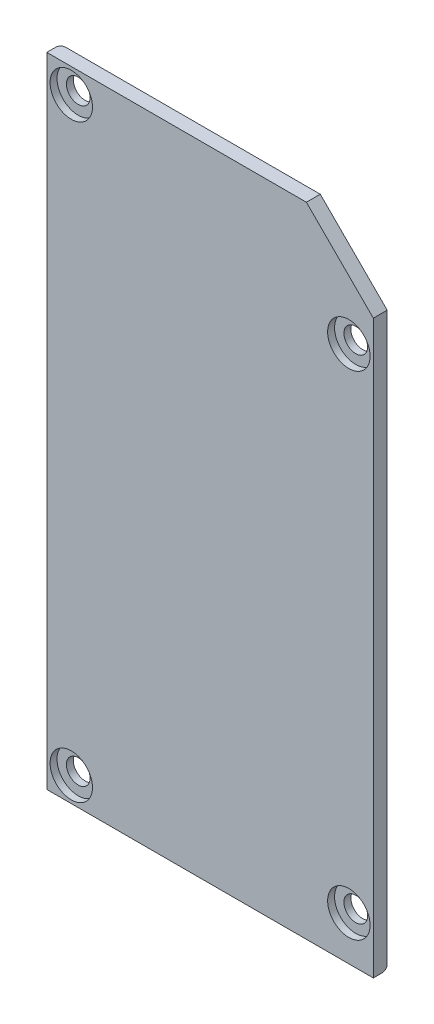
ISO-10303-21;
HEADER;
FILE_DESCRIPTION(('STEP AP214'),'2;1');
FILE_NAME('part.step','',(''),(''),'','','');
FILE_SCHEMA(('AUTOMOTIVE_DESIGN { 1 0 10303 214 1 1 1 1 }'));
ENDSEC;
DATA;
#1=APPLICATION_CONTEXT('core data for automotive mechanical design processes');
#2=APPLICATION_PROTOCOL_DEFINITION('international standard','automotive_design',2000,#1);
#3=PRODUCT_CONTEXT('',#1,'mechanical');
#4=PRODUCT('Part','Part','',(#3));
#5=PRODUCT_RELATED_PRODUCT_CATEGORY('part','',(#4));
#6=PRODUCT_DEFINITION_FORMATION('','',#4);
#7=PRODUCT_DEFINITION_CONTEXT('part definition',#1,'design');
#8=PRODUCT_DEFINITION('design','',#6,#7);
#9=PRODUCT_DEFINITION_SHAPE('','',#8);
#10=(LENGTH_UNIT() NAMED_UNIT(*) SI_UNIT(.MILLI.,.METRE.));
#11=(NAMED_UNIT(*) PLANE_ANGLE_UNIT() SI_UNIT($,.RADIAN.));
#12=(NAMED_UNIT(*) SI_UNIT($,.STERADIAN.) SOLID_ANGLE_UNIT());
#13=UNCERTAINTY_MEASURE_WITH_UNIT(LENGTH_MEASURE(1.E-05),#10,'distance_accuracy_value','');
#14=(GEOMETRIC_REPRESENTATION_CONTEXT(3) GLOBAL_UNCERTAINTY_ASSIGNED_CONTEXT((#13)) GLOBAL_UNIT_ASSIGNED_CONTEXT((#10,
#11,#12)) REPRESENTATION_CONTEXT('',''));
#15=CARTESIAN_POINT('',(0.,0.,0.));
#16=DIRECTION('',(0.,0.,1.));
#17=DIRECTION('',(1.,0.,0.));
#18=AXIS2_PLACEMENT_3D('',#15,#16,#17);
#19=CARTESIAN_POINT('',(37.,5.39999999999994,29.7));
#20=DIRECTION('',(0.,0.,-1.));
#21=DIRECTION('',(-1.,0.,0.));
#22=AXIS2_PLACEMENT_3D('',#19,#20,#21);
#23=CYLINDRICAL_SURFACE('',#22,1.45);
#24=CARTESIAN_POINT('',(37.,5.39999999999994,28.));
#25=DIRECTION('',(0.,0.,-1.));
#26=DIRECTION('',(-1.,0.,0.));
#27=AXIS2_PLACEMENT_3D('',#24,#25,#26);
#28=CIRCLE('',#27,1.45);
#29=CARTESIAN_POINT('',(35.55,5.39999999999994,28.));
#30=VERTEX_POINT('',#29);
#31=EDGE_CURVE('E238',#30,#30,#28,.T.);
#32=ORIENTED_EDGE('',*,*,#31,.T.);
#33=EDGE_LOOP('',(#32));
#34=FACE_BOUND('',#33,.T.);
#35=CARTESIAN_POINT('',(37.,5.39999999999994,28.85));
#36=DIRECTION('',(0.,0.,1.));
#37=DIRECTION('',(1.,0.,0.));
#38=AXIS2_PLACEMENT_3D('',#35,#36,#37);
#39=CIRCLE('',#38,1.45);
#40=CARTESIAN_POINT('',(38.45,5.39999999999994,28.85));
#41=VERTEX_POINT('',#40);
#42=EDGE_CURVE('E142',#41,#41,#39,.T.);
#43=ORIENTED_EDGE('',*,*,#42,.T.);
#44=EDGE_LOOP('',(#43));
#45=FACE_BOUND('',#44,.T.);
#46=ADVANCED_FACE('F37',(#34,#45),#23,.F.);
#47=CARTESIAN_POINT('',(3.,3.,29.7));
#48=DIRECTION('',(0.,0.,-1.));
#49=DIRECTION('',(-1.,0.,0.));
#50=AXIS2_PLACEMENT_3D('',#47,#48,#49);
#51=CYLINDRICAL_SURFACE('',#50,1.45);
#52=CARTESIAN_POINT('',(3.,3.,28.));
#53=DIRECTION('',(0.,0.,-1.));
#54=DIRECTION('',(-1.,0.,0.));
#55=AXIS2_PLACEMENT_3D('',#52,#53,#54);
#56=CIRCLE('',#55,1.45);
#57=CARTESIAN_POINT('',(1.55,3.,28.));
#58=VERTEX_POINT('',#57);
#59=EDGE_CURVE('E130',#58,#58,#56,.T.);
#60=ORIENTED_EDGE('',*,*,#59,.T.);
#61=EDGE_LOOP('',(#60));
#62=FACE_BOUND('',#61,.T.);
#63=CARTESIAN_POINT('',(3.,3.,28.85));
#64=DIRECTION('',(0.,0.,1.));
#65=DIRECTION('',(1.,0.,0.));
#66=AXIS2_PLACEMENT_3D('',#63,#64,#65);
#67=CIRCLE('',#66,1.45);
#68=CARTESIAN_POINT('',(4.45,3.,28.85));
#69=VERTEX_POINT('',#68);
#70=EDGE_CURVE('E137',#69,#69,#67,.T.);
#71=ORIENTED_EDGE('',*,*,#70,.T.);
#72=EDGE_LOOP('',(#71));
#73=FACE_BOUND('',#72,.T.);
#74=ADVANCED_FACE('F177',(#62,#73),#51,.F.);
#75=CARTESIAN_POINT('',(37.,65.7573593128807,29.7));
#76=DIRECTION('',(0.,0.,-1.));
#77=DIRECTION('',(-1.,0.,0.));
#78=AXIS2_PLACEMENT_3D('',#75,#76,#77);
#79=CYLINDRICAL_SURFACE('',#78,1.45);
#80=CARTESIAN_POINT('',(37.,65.7573593128807,28.));
#81=DIRECTION('',(0.,0.,-1.));
#82=DIRECTION('',(-1.,0.,0.));
#83=AXIS2_PLACEMENT_3D('',#80,#81,#82);
#84=CIRCLE('',#83,1.45);
#85=CARTESIAN_POINT('',(35.55,65.7573593128807,28.));
#86=VERTEX_POINT('',#85);
#87=EDGE_CURVE('E235',#86,#86,#84,.T.);
#88=ORIENTED_EDGE('',*,*,#87,.T.);
#89=EDGE_LOOP('',(#88));
#90=FACE_BOUND('',#89,.T.);
#91=CARTESIAN_POINT('',(37.,65.7573593128807,28.85));
#92=DIRECTION('',(0.,0.,1.));
#93=DIRECTION('',(1.,0.,0.));
#94=AXIS2_PLACEMENT_3D('',#91,#92,#93);
#95=CIRCLE('',#94,1.45);
#96=CARTESIAN_POINT('',(38.45,65.7573593128807,28.85));
#97=VERTEX_POINT('',#96);
#98=EDGE_CURVE('E132',#97,#97,#95,.T.);
#99=ORIENTED_EDGE('',*,*,#98,.T.);
#100=EDGE_LOOP('',(#99));
#101=FACE_BOUND('',#100,.T.);
#102=ADVANCED_FACE('F184',(#90,#101),#79,.F.);
#103=CARTESIAN_POINT('',(3.,75.2,29.7));
#104=DIRECTION('',(0.,0.,-1.));
#105=DIRECTION('',(-1.,0.,0.));
#106=AXIS2_PLACEMENT_3D('',#103,#104,#105);
#107=CYLINDRICAL_SURFACE('',#106,1.45);
#108=CARTESIAN_POINT('',(3.,75.2,28.));
#109=DIRECTION('',(0.,0.,-1.));
#110=DIRECTION('',(-1.,0.,0.));
#111=AXIS2_PLACEMENT_3D('',#108,#109,#110);
#112=CIRCLE('',#111,1.45);
#113=CARTESIAN_POINT('',(1.55,75.2,28.));
#114=VERTEX_POINT('',#113);
#115=EDGE_CURVE('E101',#114,#114,#112,.T.);
#116=ORIENTED_EDGE('',*,*,#115,.T.);
#117=EDGE_LOOP('',(#116));
#118=FACE_BOUND('',#117,.T.);
#119=CARTESIAN_POINT('',(3.,75.2,28.85));
#120=DIRECTION('',(0.,0.,1.));
#121=DIRECTION('',(1.,0.,0.));
#122=AXIS2_PLACEMENT_3D('',#119,#120,#121);
#123=CIRCLE('',#122,1.45);
#124=CARTESIAN_POINT('',(4.45,75.2,28.85));
#125=VERTEX_POINT('',#124);
#126=EDGE_CURVE('E127',#125,#125,#123,.T.);
#127=ORIENTED_EDGE('',*,*,#126,.T.);
#128=EDGE_LOOP('',(#127));
#129=FACE_BOUND('',#128,.T.);
#130=ADVANCED_FACE('F193',(#118,#129),#107,.F.);
#131=CARTESIAN_POINT('',(0.,0.,28.));
#132=DIRECTION('',(0.,1.,0.));
#133=DIRECTION('',(0.,0.,1.));
#134=AXIS2_PLACEMENT_3D('',#131,#132,#133);
#135=PLANE('',#134);
#136=DIRECTION('',(0.,0.,-1.));
#137=VECTOR('',#136,1.);
#138=CARTESIAN_POINT('',(0.,0.,28.));
#139=LINE('',#138,#137);
#140=CARTESIAN_POINT('',(0.,0.,29.7));
#141=VERTEX_POINT('',#140);
#142=CARTESIAN_POINT('',(0.,0.,28.6));
#143=VERTEX_POINT('',#142);
#144=EDGE_CURVE('E125',#141,#143,#139,.T.);
#145=ORIENTED_EDGE('',*,*,#144,.T.);
#146=DIRECTION('',(-1.,0.,0.));
#147=VECTOR('',#146,1.);
#148=CARTESIAN_POINT('',(40.,0.,28.6));
#149=LINE('',#148,#147);
#150=CARTESIAN_POINT('',(40.,0.,28.6));
#151=VERTEX_POINT('',#150);
#152=EDGE_CURVE('E150',#143,#151,#149,.F.);
#153=ORIENTED_EDGE('',*,*,#152,.T.);
#154=DIRECTION('',(0.,0.,-1.));
#155=VECTOR('',#154,1.);
#156=CARTESIAN_POINT('',(40.,0.,28.));
#157=LINE('',#156,#155);
#158=CARTESIAN_POINT('',(40.,0.,29.7));
#159=VERTEX_POINT('',#158);
#160=EDGE_CURVE('E118',#159,#151,#157,.T.);
#161=ORIENTED_EDGE('',*,*,#160,.F.);
#162=DIRECTION('',(1.,0.,0.));
#163=VECTOR('',#162,1.);
#164=CARTESIAN_POINT('',(40.,0.,29.7));
#165=LINE('',#164,#163);
#166=EDGE_CURVE('E221',#141,#159,#165,.T.);
#167=ORIENTED_EDGE('',*,*,#166,.F.);
#168=EDGE_LOOP('',(#145,#153,#161,#167));
#169=FACE_BOUND('',#168,.T.);
#170=ADVANCED_FACE('F197',(#169),#135,.F.);
#171=CARTESIAN_POINT('',(40.,0.,28.));
#172=DIRECTION('',(-1.,0.,0.));
#173=DIRECTION('',(0.,0.,1.));
#174=AXIS2_PLACEMENT_3D('',#171,#172,#173);
#175=PLANE('',#174);
#176=ORIENTED_EDGE('',*,*,#160,.T.);
#177=CARTESIAN_POINT('',(40.,0.6,28.6));
#178=DIRECTION('',(-1.,0.,0.));
#179=DIRECTION('',(0.,0.,1.));
#180=AXIS2_PLACEMENT_3D('',#177,#178,#179);
#181=CIRCLE('',#180,0.6);
#182=CARTESIAN_POINT('',(40.,0.6,28.));
#183=VERTEX_POINT('',#182);
#184=EDGE_CURVE('E152',#151,#183,#181,.F.);
#185=ORIENTED_EDGE('',*,*,#184,.T.);
#186=DIRECTION('',(0.,-1.,0.));
#187=VECTOR('',#186,1.);
#188=CARTESIAN_POINT('',(40.,0.,28.));
#189=LINE('',#188,#187);
#190=CARTESIAN_POINT('',(40.,70.,28.));
#191=VERTEX_POINT('',#190);
#192=EDGE_CURVE('E110',#191,#183,#189,.T.);
#193=ORIENTED_EDGE('',*,*,#192,.F.);
#194=DIRECTION('',(0.,0.,-1.));
#195=VECTOR('',#194,1.);
#196=CARTESIAN_POINT('',(40.,70.,28.));
#197=LINE('',#196,#195);
#198=CARTESIAN_POINT('',(40.,70.,29.7));
#199=VERTEX_POINT('',#198);
#200=EDGE_CURVE('E109',#199,#191,#197,.T.);
#201=ORIENTED_EDGE('',*,*,#200,.F.);
#202=DIRECTION('',(0.,1.,0.));
#203=VECTOR('',#202,1.);
#204=CARTESIAN_POINT('',(40.,70.,29.7));
#205=LINE('',#204,#203);
#206=EDGE_CURVE('E226',#159,#199,#205,.T.);
#207=ORIENTED_EDGE('',*,*,#206,.F.);
#208=EDGE_LOOP('',(#176,#185,#193,#201,#207));
#209=FACE_BOUND('',#208,.T.);
#210=ADVANCED_FACE('F156',(#209),#175,.F.);
#211=CARTESIAN_POINT('',(31.8000000000001,78.2,28.));
#212=DIRECTION('',(-0.707106781186551,-0.707106781186544,0.));
#213=DIRECTION('',(0.707106781186544,-0.707106781186551,0.));
#214=AXIS2_PLACEMENT_3D('',#211,#212,#213);
#215=PLANE('',#214);
#216=DIRECTION('',(0.707106781186544,-0.707106781186551,0.));
#217=VECTOR('',#216,1.);
#218=CARTESIAN_POINT('',(31.8000000000001,78.2,28.));
#219=LINE('',#218,#217);
#220=CARTESIAN_POINT('',(31.8000000000001,78.2,28.));
#221=VERTEX_POINT('',#220);
#222=EDGE_CURVE('E95',#221,#191,#219,.T.);
#223=ORIENTED_EDGE('',*,*,#222,.F.);
#224=DIRECTION('',(0.,0.,-1.));
#225=VECTOR('',#224,1.);
#226=CARTESIAN_POINT('',(31.8000000000001,78.2,28.));
#227=LINE('',#226,#225);
#228=CARTESIAN_POINT('',(31.8000000000001,78.2,29.7));
#229=VERTEX_POINT('',#228);
#230=EDGE_CURVE('E107',#229,#221,#227,.T.);
#231=ORIENTED_EDGE('',*,*,#230,.F.);
#232=DIRECTION('',(-0.707106781186544,0.707106781186551,0.));
#233=VECTOR('',#232,1.);
#234=CARTESIAN_POINT('',(31.8000000000001,78.2,29.7));
#235=LINE('',#234,#233);
#236=EDGE_CURVE('E231',#199,#229,#235,.T.);
#237=ORIENTED_EDGE('',*,*,#236,.F.);
#238=ORIENTED_EDGE('',*,*,#200,.T.);
#239=EDGE_LOOP('',(#223,#231,#237,#238));
#240=FACE_BOUND('',#239,.T.);
#241=ADVANCED_FACE('F105',(#240),#215,.F.);
#242=CARTESIAN_POINT('',(0.,78.2,28.));
#243=DIRECTION('',(0.,-1.,0.));
#244=DIRECTION('',(0.,0.,-1.));
#245=AXIS2_PLACEMENT_3D('',#242,#243,#244);
#246=PLANE('',#245);
#247=DIRECTION('',(1.,0.,0.));
#248=VECTOR('',#247,1.);
#249=CARTESIAN_POINT('',(0.,78.2,28.));
#250=LINE('',#249,#248);
#251=CARTESIAN_POINT('',(0.6,78.2,28.));
#252=VERTEX_POINT('',#251);
#253=EDGE_CURVE('E90',#252,#221,#250,.T.);
#254=ORIENTED_EDGE('',*,*,#253,.F.);
#255=CARTESIAN_POINT('',(0.6,78.2,28.6));
#256=DIRECTION('',(0.,-1.,0.));
#257=DIRECTION('',(0.,0.,-1.));
#258=AXIS2_PLACEMENT_3D('',#255,#256,#257);
#259=CIRCLE('',#258,0.6);
#260=CARTESIAN_POINT('',(0.,78.2,28.6));
#261=VERTEX_POINT('',#260);
#262=EDGE_CURVE('E11',#252,#261,#259,.F.);
#263=ORIENTED_EDGE('',*,*,#262,.T.);
#264=DIRECTION('',(0.,0.,-1.));
#265=VECTOR('',#264,1.);
#266=CARTESIAN_POINT('',(0.,78.2,28.));
#267=LINE('',#266,#265);
#268=CARTESIAN_POINT('',(0.,78.2,29.7));
#269=VERTEX_POINT('',#268);
#270=EDGE_CURVE('E116',#269,#261,#267,.T.);
#271=ORIENTED_EDGE('',*,*,#270,.F.);
#272=DIRECTION('',(-1.,0.,0.));
#273=VECTOR('',#272,1.);
#274=CARTESIAN_POINT('',(0.,78.2,29.7));
#275=LINE('',#274,#273);
#276=EDGE_CURVE('E115',#229,#269,#275,.T.);
#277=ORIENTED_EDGE('',*,*,#276,.F.);
#278=ORIENTED_EDGE('',*,*,#230,.T.);
#279=EDGE_LOOP('',(#254,#263,#271,#277,#278));
#280=FACE_BOUND('',#279,.T.);
#281=ADVANCED_FACE('F113',(#280),#246,.F.);
#282=CARTESIAN_POINT('',(0.,78.2,28.));
#283=DIRECTION('',(1.,0.,0.));
#284=DIRECTION('',(0.,0.,-1.));
#285=AXIS2_PLACEMENT_3D('',#282,#283,#284);
#286=PLANE('',#285);
#287=ORIENTED_EDGE('',*,*,#270,.T.);
#288=DIRECTION('',(0.,-1.,0.));
#289=VECTOR('',#288,1.);
#290=CARTESIAN_POINT('',(0.,0.,28.6));
#291=LINE('',#290,#289);
#292=EDGE_CURVE('E46',#261,#143,#291,.T.);
#293=ORIENTED_EDGE('',*,*,#292,.T.);
#294=ORIENTED_EDGE('',*,*,#144,.F.);
#295=DIRECTION('',(0.,-1.,0.));
#296=VECTOR('',#295,1.);
#297=CARTESIAN_POINT('',(0.,0.,29.7));
#298=LINE('',#297,#296);
#299=EDGE_CURVE('E161',#269,#141,#298,.T.);
#300=ORIENTED_EDGE('',*,*,#299,.F.);
#301=EDGE_LOOP('',(#287,#293,#294,#300));
#302=FACE_BOUND('',#301,.T.);
#303=ADVANCED_FACE('F202',(#302),#286,.F.);
#304=CARTESIAN_POINT('',(0.,0.,29.7));
#305=DIRECTION('',(0.,0.,-1.));
#306=DIRECTION('',(-1.,0.,0.));
#307=AXIS2_PLACEMENT_3D('',#304,#305,#306);
#308=PLANE('',#307);
#309=CARTESIAN_POINT('',(37.,5.39999999999994,29.7));
#310=DIRECTION('',(0.,0.,1.));
#311=DIRECTION('',(1.,0.,0.));
#312=AXIS2_PLACEMENT_3D('',#309,#310,#311);
#313=CIRCLE('',#312,2.6);
#314=CARTESIAN_POINT('',(39.6,5.39999999999994,29.7));
#315=VERTEX_POINT('',#314);
#316=EDGE_CURVE('E166',#315,#315,#313,.T.);
#317=ORIENTED_EDGE('',*,*,#316,.F.);
#318=EDGE_LOOP('',(#317));
#319=FACE_BOUND('',#318,.T.);
#320=CARTESIAN_POINT('',(3.,3.,29.7));
#321=DIRECTION('',(0.,0.,1.));
#322=DIRECTION('',(1.,0.,0.));
#323=AXIS2_PLACEMENT_3D('',#320,#321,#322);
#324=CIRCLE('',#323,2.6);
#325=CARTESIAN_POINT('',(5.6,3.,29.7));
#326=VERTEX_POINT('',#325);
#327=EDGE_CURVE('E145',#326,#326,#324,.T.);
#328=ORIENTED_EDGE('',*,*,#327,.F.);
#329=EDGE_LOOP('',(#328));
#330=FACE_BOUND('',#329,.T.);
#331=CARTESIAN_POINT('',(37.,65.7573593128807,29.7));
#332=DIRECTION('',(0.,0.,1.));
#333=DIRECTION('',(1.,0.,0.));
#334=AXIS2_PLACEMENT_3D('',#331,#332,#333);
#335=CIRCLE('',#334,2.6);
#336=CARTESIAN_POINT('',(39.6,65.7573593128807,29.7));
#337=VERTEX_POINT('',#336);
#338=EDGE_CURVE('E140',#337,#337,#335,.T.);
#339=ORIENTED_EDGE('',*,*,#338,.F.);
#340=EDGE_LOOP('',(#339));
#341=FACE_BOUND('',#340,.T.);
#342=CARTESIAN_POINT('',(3.,75.2,29.7));
#343=DIRECTION('',(0.,0.,1.));
#344=DIRECTION('',(1.,0.,0.));
#345=AXIS2_PLACEMENT_3D('',#342,#343,#344);
#346=CIRCLE('',#345,2.6);
#347=CARTESIAN_POINT('',(5.6,75.2,29.7));
#348=VERTEX_POINT('',#347);
#349=EDGE_CURVE('E135',#348,#348,#346,.T.);
#350=ORIENTED_EDGE('',*,*,#349,.F.);
#351=EDGE_LOOP('',(#350));
#352=FACE_BOUND('',#351,.T.);
#353=ORIENTED_EDGE('',*,*,#299,.T.);
#354=ORIENTED_EDGE('',*,*,#166,.T.);
#355=ORIENTED_EDGE('',*,*,#206,.T.);
#356=ORIENTED_EDGE('',*,*,#236,.T.);
#357=ORIENTED_EDGE('',*,*,#276,.T.);
#358=EDGE_LOOP('',(#353,#354,#355,#356,#357));
#359=FACE_BOUND('',#358,.T.);
#360=ADVANCED_FACE('F199',(#319,#330,#341,#352,#359),#308,.F.);
#361=CARTESIAN_POINT('',(0.,0.,28.));
#362=DIRECTION('',(0.,0.,-1.));
#363=DIRECTION('',(-1.,0.,0.));
#364=AXIS2_PLACEMENT_3D('',#361,#362,#363);
#365=PLANE('',#364);
#366=ORIENTED_EDGE('',*,*,#192,.T.);
#367=DIRECTION('',(-1.,0.,0.));
#368=VECTOR('',#367,1.);
#369=CARTESIAN_POINT('',(0.,0.6,28.));
#370=LINE('',#369,#368);
#371=CARTESIAN_POINT('',(0.6,0.6,28.));
#372=VERTEX_POINT('',#371);
#373=EDGE_CURVE('E148',#183,#372,#370,.T.);
#374=ORIENTED_EDGE('',*,*,#373,.T.);
#375=DIRECTION('',(0.,-1.,0.));
#376=VECTOR('',#375,1.);
#377=CARTESIAN_POINT('',(0.6,78.2,28.));
#378=LINE('',#377,#376);
#379=EDGE_CURVE('E99',#372,#252,#378,.F.);
#380=ORIENTED_EDGE('',*,*,#379,.T.);
#381=ORIENTED_EDGE('',*,*,#253,.T.);
#382=ORIENTED_EDGE('',*,*,#222,.T.);
#383=EDGE_LOOP('',(#366,#374,#380,#381,#382));
#384=FACE_BOUND('',#383,.T.);
#385=ORIENTED_EDGE('',*,*,#59,.F.);
#386=EDGE_LOOP('',(#385));
#387=FACE_BOUND('',#386,.T.);
#388=ORIENTED_EDGE('',*,*,#31,.F.);
#389=EDGE_LOOP('',(#388));
#390=FACE_BOUND('',#389,.T.);
#391=ORIENTED_EDGE('',*,*,#87,.F.);
#392=EDGE_LOOP('',(#391));
#393=FACE_BOUND('',#392,.T.);
#394=ORIENTED_EDGE('',*,*,#115,.F.);
#395=EDGE_LOOP('',(#394));
#396=FACE_BOUND('',#395,.T.);
#397=ADVANCED_FACE('F93',(#384,#387,#390,#393,#396),#365,.T.);
#398=CARTESIAN_POINT('',(3.,75.2,28.85));
#399=DIRECTION('',(0.,0.,1.));
#400=DIRECTION('',(1.,0.,0.));
#401=AXIS2_PLACEMENT_3D('',#398,#399,#400);
#402=CYLINDRICAL_SURFACE('',#401,2.6);
#403=CARTESIAN_POINT('',(3.,75.2,28.85));
#404=DIRECTION('',(0.,0.,1.));
#405=DIRECTION('',(1.,0.,0.));
#406=AXIS2_PLACEMENT_3D('',#403,#404,#405);
#407=CIRCLE('',#406,2.6);
#408=CARTESIAN_POINT('',(5.6,75.2,28.85));
#409=VERTEX_POINT('',#408);
#410=EDGE_CURVE('E131',#409,#409,#407,.T.);
#411=ORIENTED_EDGE('',*,*,#410,.F.);
#412=EDGE_LOOP('',(#411));
#413=FACE_BOUND('',#412,.T.);
#414=ORIENTED_EDGE('',*,*,#349,.T.);
#415=EDGE_LOOP('',(#414));
#416=FACE_BOUND('',#415,.T.);
#417=ADVANCED_FACE('F206',(#413,#416),#402,.F.);
#418=CARTESIAN_POINT('',(3.,75.2,28.85));
#419=DIRECTION('',(0.,0.,1.));
#420=DIRECTION('',(1.,0.,0.));
#421=AXIS2_PLACEMENT_3D('',#418,#419,#420);
#422=PLANE('',#421);
#423=ORIENTED_EDGE('',*,*,#126,.F.);
#424=EDGE_LOOP('',(#423));
#425=FACE_BOUND('',#424,.T.);
#426=ORIENTED_EDGE('',*,*,#410,.T.);
#427=EDGE_LOOP('',(#426));
#428=FACE_BOUND('',#427,.T.);
#429=ADVANCED_FACE('F273',(#425,#428),#422,.T.);
#430=CARTESIAN_POINT('',(37.,65.7573593128807,28.85));
#431=DIRECTION('',(0.,0.,1.));
#432=DIRECTION('',(1.,0.,0.));
#433=AXIS2_PLACEMENT_3D('',#430,#431,#432);
#434=CYLINDRICAL_SURFACE('',#433,2.6);
#435=CARTESIAN_POINT('',(37.,65.7573593128807,28.85));
#436=DIRECTION('',(0.,0.,1.));
#437=DIRECTION('',(1.,0.,0.));
#438=AXIS2_PLACEMENT_3D('',#435,#436,#437);
#439=CIRCLE('',#438,2.6);
#440=CARTESIAN_POINT('',(39.6,65.7573593128807,28.85));
#441=VERTEX_POINT('',#440);
#442=EDGE_CURVE('E136',#441,#441,#439,.T.);
#443=ORIENTED_EDGE('',*,*,#442,.F.);
#444=EDGE_LOOP('',(#443));
#445=FACE_BOUND('',#444,.T.);
#446=ORIENTED_EDGE('',*,*,#338,.T.);
#447=EDGE_LOOP('',(#446));
#448=FACE_BOUND('',#447,.T.);
#449=ADVANCED_FACE('F278',(#445,#448),#434,.F.);
#450=CARTESIAN_POINT('',(37.,65.7573593128807,28.85));
#451=DIRECTION('',(0.,0.,1.));
#452=DIRECTION('',(1.,0.,0.));
#453=AXIS2_PLACEMENT_3D('',#450,#451,#452);
#454=PLANE('',#453);
#455=ORIENTED_EDGE('',*,*,#98,.F.);
#456=EDGE_LOOP('',(#455));
#457=FACE_BOUND('',#456,.T.);
#458=ORIENTED_EDGE('',*,*,#442,.T.);
#459=EDGE_LOOP('',(#458));
#460=FACE_BOUND('',#459,.T.);
#461=ADVANCED_FACE('F285',(#457,#460),#454,.T.);
#462=CARTESIAN_POINT('',(3.,3.,28.85));
#463=DIRECTION('',(0.,0.,1.));
#464=DIRECTION('',(1.,0.,0.));
#465=AXIS2_PLACEMENT_3D('',#462,#463,#464);
#466=CYLINDRICAL_SURFACE('',#465,2.6);
#467=CARTESIAN_POINT('',(3.,3.,28.85));
#468=DIRECTION('',(0.,0.,1.));
#469=DIRECTION('',(1.,0.,0.));
#470=AXIS2_PLACEMENT_3D('',#467,#468,#469);
#471=CIRCLE('',#470,2.6);
#472=CARTESIAN_POINT('',(5.6,3.,28.85));
#473=VERTEX_POINT('',#472);
#474=EDGE_CURVE('E141',#473,#473,#471,.T.);
#475=ORIENTED_EDGE('',*,*,#474,.F.);
#476=EDGE_LOOP('',(#475));
#477=FACE_BOUND('',#476,.T.);
#478=ORIENTED_EDGE('',*,*,#327,.T.);
#479=EDGE_LOOP('',(#478));
#480=FACE_BOUND('',#479,.T.);
#481=ADVANCED_FACE('F289',(#477,#480),#466,.F.);
#482=CARTESIAN_POINT('',(3.,3.,28.85));
#483=DIRECTION('',(0.,0.,1.));
#484=DIRECTION('',(1.,0.,0.));
#485=AXIS2_PLACEMENT_3D('',#482,#483,#484);
#486=PLANE('',#485);
#487=ORIENTED_EDGE('',*,*,#70,.F.);
#488=EDGE_LOOP('',(#487));
#489=FACE_BOUND('',#488,.T.);
#490=ORIENTED_EDGE('',*,*,#474,.T.);
#491=EDGE_LOOP('',(#490));
#492=FACE_BOUND('',#491,.T.);
#493=ADVANCED_FACE('F262',(#489,#492),#486,.T.);
#494=CARTESIAN_POINT('',(37.,5.39999999999994,28.85));
#495=DIRECTION('',(0.,0.,1.));
#496=DIRECTION('',(1.,0.,0.));
#497=AXIS2_PLACEMENT_3D('',#494,#495,#496);
#498=CYLINDRICAL_SURFACE('',#497,2.6);
#499=CARTESIAN_POINT('',(37.,5.39999999999994,28.85));
#500=DIRECTION('',(0.,0.,1.));
#501=DIRECTION('',(1.,0.,0.));
#502=AXIS2_PLACEMENT_3D('',#499,#500,#501);
#503=CIRCLE('',#502,2.6);
#504=CARTESIAN_POINT('',(39.6,5.39999999999994,28.85));
#505=VERTEX_POINT('',#504);
#506=EDGE_CURVE('E146',#505,#505,#503,.T.);
#507=ORIENTED_EDGE('',*,*,#506,.F.);
#508=EDGE_LOOP('',(#507));
#509=FACE_BOUND('',#508,.T.);
#510=ORIENTED_EDGE('',*,*,#316,.T.);
#511=EDGE_LOOP('',(#510));
#512=FACE_BOUND('',#511,.T.);
#513=ADVANCED_FACE('F173',(#509,#512),#498,.F.);
#514=CARTESIAN_POINT('',(37.,5.39999999999994,28.85));
#515=DIRECTION('',(0.,0.,1.));
#516=DIRECTION('',(1.,0.,0.));
#517=AXIS2_PLACEMENT_3D('',#514,#515,#516);
#518=PLANE('',#517);
#519=ORIENTED_EDGE('',*,*,#42,.F.);
#520=EDGE_LOOP('',(#519));
#521=FACE_BOUND('',#520,.T.);
#522=ORIENTED_EDGE('',*,*,#506,.T.);
#523=EDGE_LOOP('',(#522));
#524=FACE_BOUND('',#523,.T.);
#525=ADVANCED_FACE('F168',(#521,#524),#518,.T.);
#526=CARTESIAN_POINT('',(0.6,78.2,28.6));
#527=DIRECTION('',(0.,1.,0.));
#528=DIRECTION('',(0.,0.,1.));
#529=AXIS2_PLACEMENT_3D('',#526,#527,#528);
#530=CYLINDRICAL_SURFACE('',#529,0.6);
#531=ORIENTED_EDGE('',*,*,#262,.F.);
#532=ORIENTED_EDGE('',*,*,#379,.F.);
#533=CARTESIAN_POINT('',(0.6,0.600000000000002,28.6));
#534=DIRECTION('',(-0.707106781186547,0.707106781186547,0.));
#535=DIRECTION('',(0.707106781186547,0.707106781186547,0.));
#536=AXIS2_PLACEMENT_3D('',#533,#534,#535);
#537=ELLIPSE('',#536,0.848528137423857,0.6);
#538=EDGE_CURVE('E41',#143,#372,#537,.F.);
#539=ORIENTED_EDGE('',*,*,#538,.F.);
#540=ORIENTED_EDGE('',*,*,#292,.F.);
#541=EDGE_LOOP('',(#531,#532,#539,#540));
#542=FACE_BOUND('',#541,.T.);
#543=ADVANCED_FACE('F39',(#542),#530,.T.);
#544=CARTESIAN_POINT('',(0.,0.6,28.6));
#545=DIRECTION('',(1.,0.,0.));
#546=DIRECTION('',(0.,0.,-1.));
#547=AXIS2_PLACEMENT_3D('',#544,#545,#546);
#548=CYLINDRICAL_SURFACE('',#547,0.6);
#549=ORIENTED_EDGE('',*,*,#184,.F.);
#550=ORIENTED_EDGE('',*,*,#152,.F.);
#551=ORIENTED_EDGE('',*,*,#538,.T.);
#552=ORIENTED_EDGE('',*,*,#373,.F.);
#553=EDGE_LOOP('',(#549,#550,#551,#552));
#554=FACE_BOUND('',#553,.T.);
#555=ADVANCED_FACE('F163',(#554),#548,.T.);
#556=CLOSED_SHELL('',(#46,#74,#102,#130,#170,#210,#241,#281,#303,#360,#397,#417,#429,#449,#461,
#481,#493,#513,#525,#543,#555));
#557=MANIFOLD_SOLID_BREP('B2',#556);
#558=ADVANCED_BREP_SHAPE_REPRESENTATION('',(#18,#557),#14);
#559=SHAPE_DEFINITION_REPRESENTATION(#9,#558);
ENDSEC;
END-ISO-10303-21;
